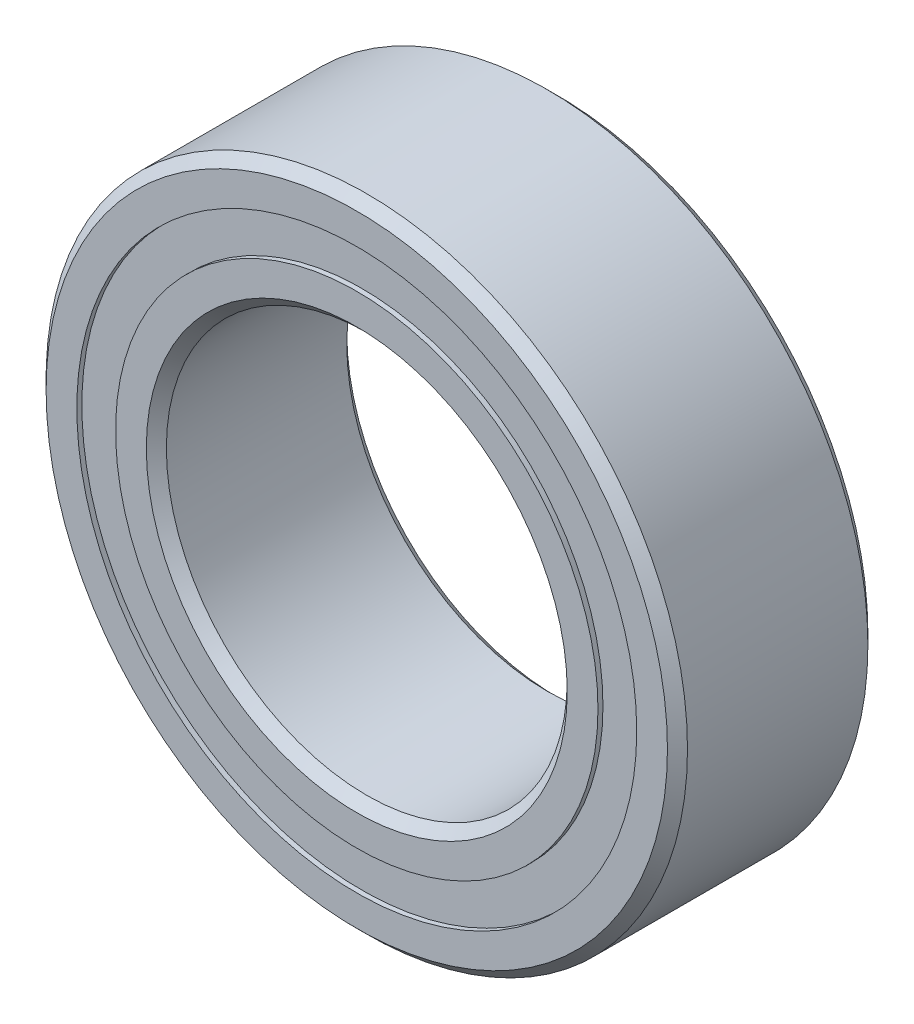
ISO-10303-21;
HEADER;
FILE_DESCRIPTION(('STEP AP214'),'2;1');
FILE_NAME('part.step','',(''),(''),'','','');
FILE_SCHEMA(('AUTOMOTIVE_DESIGN { 1 0 10303 214 1 1 1 1 }'));
ENDSEC;
DATA;
#1=APPLICATION_CONTEXT('core data for automotive mechanical design processes');
#2=APPLICATION_PROTOCOL_DEFINITION('international standard','automotive_design',2000,#1);
#3=PRODUCT_CONTEXT('',#1,'mechanical');
#4=PRODUCT('Part','Part','',(#3));
#5=PRODUCT_RELATED_PRODUCT_CATEGORY('part','',(#4));
#6=PRODUCT_DEFINITION_FORMATION('','',#4);
#7=PRODUCT_DEFINITION_CONTEXT('part definition',#1,'design');
#8=PRODUCT_DEFINITION('design','',#6,#7);
#9=PRODUCT_DEFINITION_SHAPE('','',#8);
#10=(LENGTH_UNIT() NAMED_UNIT(*) SI_UNIT(.MILLI.,.METRE.));
#11=(NAMED_UNIT(*) PLANE_ANGLE_UNIT() SI_UNIT($,.RADIAN.));
#12=(NAMED_UNIT(*) SI_UNIT($,.STERADIAN.) SOLID_ANGLE_UNIT());
#13=UNCERTAINTY_MEASURE_WITH_UNIT(LENGTH_MEASURE(1.E-05),#10,'distance_accuracy_value','');
#14=(GEOMETRIC_REPRESENTATION_CONTEXT(3) GLOBAL_UNCERTAINTY_ASSIGNED_CONTEXT((#13)) GLOBAL_UNIT_ASSIGNED_CONTEXT((#10,
#11,#12)) REPRESENTATION_CONTEXT('',''));
#15=CARTESIAN_POINT('',(0.,0.,0.));
#16=DIRECTION('',(0.,0.,1.));
#17=DIRECTION('',(1.,0.,0.));
#18=AXIS2_PLACEMENT_3D('',#15,#16,#17);
#19=CARTESIAN_POINT('',(0.,3.49175824175824,-1.1875));
#20=DIRECTION('',(0.,0.,1.));
#21=DIRECTION('',(1.,0.,0.));
#22=AXIS2_PLACEMENT_3D('',#19,#20,#21);
#23=PLANE('',#22);
#24=CARTESIAN_POINT('',(0.,0.,-1.1875));
#25=DIRECTION('',(0.,0.,1.));
#26=DIRECTION('',(1.,0.,0.));
#27=AXIS2_PLACEMENT_3D('',#24,#25,#26);
#28=CIRCLE('',#27,3.49175824175824);
#29=CARTESIAN_POINT('',(3.49175824175824,0.,-1.1875));
#30=VERTEX_POINT('',#29);
#31=EDGE_CURVE('E55',#30,#30,#28,.T.);
#32=ORIENTED_EDGE('',*,*,#31,.F.);
#33=EDGE_LOOP('',(#32));
#34=FACE_BOUND('',#33,.T.);
#35=CARTESIAN_POINT('',(0.,0.,-1.1875));
#36=DIRECTION('',(0.,0.,1.));
#37=DIRECTION('',(1.,0.,0.));
#38=AXIS2_PLACEMENT_3D('',#35,#36,#37);
#39=CIRCLE('',#38,3.00824175824176);
#40=CARTESIAN_POINT('',(3.00824175824176,0.,-1.1875));
#41=VERTEX_POINT('',#40);
#42=EDGE_CURVE('E11',#41,#41,#39,.T.);
#43=ORIENTED_EDGE('',*,*,#42,.T.);
#44=EDGE_LOOP('',(#43));
#45=FACE_BOUND('',#44,.T.);
#46=ADVANCED_FACE('F41',(#34,#45),#23,.F.);
#47=CARTESIAN_POINT('',(0.,0.,1.25));
#48=DIRECTION('',(0.,0.,1.));
#49=DIRECTION('',(1.,0.,0.));
#50=AXIS2_PLACEMENT_3D('',#47,#48,#49);
#51=CYLINDRICAL_SURFACE('',#50,3.00824175824176);
#52=ORIENTED_EDGE('',*,*,#42,.F.);
#53=EDGE_LOOP('',(#52));
#54=FACE_BOUND('',#53,.T.);
#55=CARTESIAN_POINT('',(0.,0.,-0.605878719519574));
#56=DIRECTION('',(0.,0.,1.));
#57=DIRECTION('',(1.,0.,0.));
#58=AXIS2_PLACEMENT_3D('',#55,#56,#57);
#59=CIRCLE('',#58,3.00824175824176);
#60=CARTESIAN_POINT('',(3.00824175824176,0.,-0.605878719519574));
#61=VERTEX_POINT('',#60);
#62=EDGE_CURVE('E47',#61,#61,#59,.T.);
#63=ORIENTED_EDGE('',*,*,#62,.T.);
#64=EDGE_LOOP('',(#63));
#65=FACE_BOUND('',#64,.T.);
#66=ADVANCED_FACE('F64',(#54,#65),#51,.F.);
#67=CARTESIAN_POINT('',(0.,3.49175824175824,-0.605878719519574));
#68=DIRECTION('',(0.,0.,-1.));
#69=DIRECTION('',(-1.,0.,0.));
#70=AXIS2_PLACEMENT_3D('',#67,#68,#69);
#71=PLANE('',#70);
#72=ORIENTED_EDGE('',*,*,#62,.F.);
#73=EDGE_LOOP('',(#72));
#74=FACE_BOUND('',#73,.T.);
#75=CARTESIAN_POINT('',(0.,0.,-0.605878719519574));
#76=DIRECTION('',(0.,0.,1.));
#77=DIRECTION('',(1.,0.,0.));
#78=AXIS2_PLACEMENT_3D('',#75,#76,#77);
#79=CIRCLE('',#78,3.49175824175824);
#80=CARTESIAN_POINT('',(3.49175824175824,0.,-0.605878719519574));
#81=VERTEX_POINT('',#80);
#82=EDGE_CURVE('E51',#81,#81,#79,.T.);
#83=ORIENTED_EDGE('',*,*,#82,.T.);
#84=EDGE_LOOP('',(#83));
#85=FACE_BOUND('',#84,.T.);
#86=ADVANCED_FACE('F68',(#74,#85),#71,.F.);
#87=CARTESIAN_POINT('',(0.,0.,1.25));
#88=DIRECTION('',(0.,0.,1.));
#89=DIRECTION('',(1.,0.,0.));
#90=AXIS2_PLACEMENT_3D('',#87,#88,#89);
#91=CYLINDRICAL_SURFACE('',#90,3.49175824175824);
#92=ORIENTED_EDGE('',*,*,#82,.F.);
#93=EDGE_LOOP('',(#92));
#94=FACE_BOUND('',#93,.T.);
#95=ORIENTED_EDGE('',*,*,#31,.T.);
#96=EDGE_LOOP('',(#95));
#97=FACE_BOUND('',#96,.T.);
#98=ADVANCED_FACE('F61',(#94,#97),#91,.T.);
#99=CLOSED_SHELL('',(#46,#66,#86,#98));
#100=MANIFOLD_SOLID_BREP('B2',#99);
#101=CARTESIAN_POINT('',(0.,3.49175824175824,1.1875));
#102=DIRECTION('',(0.,0.,-1.));
#103=DIRECTION('',(-1.,0.,0.));
#104=AXIS2_PLACEMENT_3D('',#101,#102,#103);
#105=PLANE('',#104);
#106=CARTESIAN_POINT('',(0.,0.,1.1875));
#107=DIRECTION('',(0.,0.,1.));
#108=DIRECTION('',(1.,0.,0.));
#109=AXIS2_PLACEMENT_3D('',#106,#107,#108);
#110=CIRCLE('',#109,3.00824175824176);
#111=CARTESIAN_POINT('',(3.00824175824176,0.,1.1875));
#112=VERTEX_POINT('',#111);
#113=EDGE_CURVE('E40',#112,#112,#110,.T.);
#114=ORIENTED_EDGE('',*,*,#113,.F.);
#115=EDGE_LOOP('',(#114));
#116=FACE_BOUND('',#115,.T.);
#117=CARTESIAN_POINT('',(0.,0.,1.1875));
#118=DIRECTION('',(0.,0.,1.));
#119=DIRECTION('',(1.,0.,0.));
#120=AXIS2_PLACEMENT_3D('',#117,#118,#119);
#121=CIRCLE('',#120,3.49175824175824);
#122=CARTESIAN_POINT('',(3.49175824175824,0.,1.1875));
#123=VERTEX_POINT('',#122);
#124=EDGE_CURVE('E122',#123,#123,#121,.T.);
#125=ORIENTED_EDGE('',*,*,#124,.T.);
#126=EDGE_LOOP('',(#125));
#127=FACE_BOUND('',#126,.T.);
#128=ADVANCED_FACE('F108',(#116,#127),#105,.F.);
#129=CARTESIAN_POINT('',(0.,0.,1.25));
#130=DIRECTION('',(0.,0.,1.));
#131=DIRECTION('',(1.,0.,0.));
#132=AXIS2_PLACEMENT_3D('',#129,#130,#131);
#133=CYLINDRICAL_SURFACE('',#132,3.00824175824176);
#134=CARTESIAN_POINT('',(0.,0.,0.605878719519573));
#135=DIRECTION('',(0.,0.,1.));
#136=DIRECTION('',(1.,0.,0.));
#137=AXIS2_PLACEMENT_3D('',#134,#135,#136);
#138=CIRCLE('',#137,3.00824175824176);
#139=CARTESIAN_POINT('',(3.00824175824176,0.,0.605878719519573));
#140=VERTEX_POINT('',#139);
#141=EDGE_CURVE('E114',#140,#140,#138,.T.);
#142=ORIENTED_EDGE('',*,*,#141,.F.);
#143=EDGE_LOOP('',(#142));
#144=FACE_BOUND('',#143,.T.);
#145=ORIENTED_EDGE('',*,*,#113,.T.);
#146=EDGE_LOOP('',(#145));
#147=FACE_BOUND('',#146,.T.);
#148=ADVANCED_FACE('F137',(#144,#147),#133,.F.);
#149=CARTESIAN_POINT('',(0.,3.49175824175824,0.605878719519573));
#150=DIRECTION('',(0.,0.,1.));
#151=DIRECTION('',(1.,0.,0.));
#152=AXIS2_PLACEMENT_3D('',#149,#150,#151);
#153=PLANE('',#152);
#154=CARTESIAN_POINT('',(0.,0.,0.605878719519573));
#155=DIRECTION('',(0.,0.,1.));
#156=DIRECTION('',(1.,0.,0.));
#157=AXIS2_PLACEMENT_3D('',#154,#155,#156);
#158=CIRCLE('',#157,3.49175824175824);
#159=CARTESIAN_POINT('',(3.49175824175824,0.,0.605878719519573));
#160=VERTEX_POINT('',#159);
#161=EDGE_CURVE('E118',#160,#160,#158,.T.);
#162=ORIENTED_EDGE('',*,*,#161,.F.);
#163=EDGE_LOOP('',(#162));
#164=FACE_BOUND('',#163,.T.);
#165=ORIENTED_EDGE('',*,*,#141,.T.);
#166=EDGE_LOOP('',(#165));
#167=FACE_BOUND('',#166,.T.);
#168=ADVANCED_FACE('F132',(#164,#167),#153,.F.);
#169=CARTESIAN_POINT('',(0.,0.,1.25));
#170=DIRECTION('',(0.,0.,1.));
#171=DIRECTION('',(1.,0.,0.));
#172=AXIS2_PLACEMENT_3D('',#169,#170,#171);
#173=CYLINDRICAL_SURFACE('',#172,3.49175824175824);
#174=ORIENTED_EDGE('',*,*,#124,.F.);
#175=EDGE_LOOP('',(#174));
#176=FACE_BOUND('',#175,.T.);
#177=ORIENTED_EDGE('',*,*,#161,.T.);
#178=EDGE_LOOP('',(#177));
#179=FACE_BOUND('',#178,.T.);
#180=ADVANCED_FACE('F129',(#176,#179),#173,.T.);
#181=CLOSED_SHELL('',(#128,#148,#168,#180));
#182=MANIFOLD_SOLID_BREP('B6',#181);
#183=CARTESIAN_POINT('',(-1.62499999999996,2.81458256229945,0.));
#184=DIRECTION('',(0.,0.,1.));
#185=DIRECTION('',(-0.499999999999989,0.866025403784445,0.));
#186=AXIS2_PLACEMENT_3D('',#183,#184,#185);
#187=SPHERICAL_SURFACE('',#186,0.605878719519574);
#188=CARTESIAN_POINT('',(-1.62499999999996,2.81458256229945,0.605878719519573));
#189=VERTEX_POINT('',#188);
#190=VERTEX_LOOP('',#189);
#191=FACE_BOUND('',#190,.T.);
#192=ADVANCED_FACE('F175',(#191),#187,.T.);
#193=CLOSED_SHELL('',(#192));
#194=MANIFOLD_SOLID_BREP('B35',#193);
#195=CARTESIAN_POINT('',(-2.81458256229941,1.62500000000003,0.));
#196=DIRECTION('',(0.,0.,1.));
#197=DIRECTION('',(-0.866025403784433,0.50000000000001,0.));
#198=AXIS2_PLACEMENT_3D('',#195,#196,#197);
#199=SPHERICAL_SURFACE('',#198,0.605878719519574);
#200=CARTESIAN_POINT('',(-2.81458256229941,1.62500000000003,0.605878719519573));
#201=VERTEX_POINT('',#200);
#202=VERTEX_LOOP('',#201);
#203=FACE_BOUND('',#202,.T.);
#204=ADVANCED_FACE('F195',(#203),#199,.T.);
#205=CLOSED_SHELL('',(#204));
#206=MANIFOLD_SOLID_BREP('B104',#205);
#207=CARTESIAN_POINT('',(-3.25,0.,0.));
#208=DIRECTION('',(0.,0.,1.));
#209=DIRECTION('',(-1.,0.,0.));
#210=AXIS2_PLACEMENT_3D('',#207,#208,#209);
#211=SPHERICAL_SURFACE('',#210,0.605878719519574);
#212=CARTESIAN_POINT('',(-3.25,0.,0.605878719519573));
#213=VERTEX_POINT('',#212);
#214=VERTEX_LOOP('',#213);
#215=FACE_BOUND('',#214,.T.);
#216=ADVANCED_FACE('F215',(#215),#211,.T.);
#217=CLOSED_SHELL('',(#216));
#218=MANIFOLD_SOLID_BREP('B171',#217);
#219=CARTESIAN_POINT('',(-2.81458256229944,-1.62499999999997,0.));
#220=DIRECTION('',(0.,0.,1.));
#221=DIRECTION('',(-0.866025403784443,-0.499999999999992,0.));
#222=AXIS2_PLACEMENT_3D('',#219,#220,#221);
#223=SPHERICAL_SURFACE('',#222,0.605878719519574);
#224=CARTESIAN_POINT('',(-2.81458256229944,-1.62499999999997,0.605878719519573));
#225=VERTEX_POINT('',#224);
#226=VERTEX_LOOP('',#225);
#227=FACE_BOUND('',#226,.T.);
#228=ADVANCED_FACE('F235',(#227),#223,.T.);
#229=CLOSED_SHELL('',(#228));
#230=MANIFOLD_SOLID_BREP('B191',#229);
#231=CARTESIAN_POINT('',(-1.62500000000002,-2.81458256229941,0.));
#232=DIRECTION('',(0.,0.,1.));
#233=DIRECTION('',(-0.500000000000007,-0.866025403784435,0.));
#234=AXIS2_PLACEMENT_3D('',#231,#232,#233);
#235=SPHERICAL_SURFACE('',#234,0.605878719519574);
#236=CARTESIAN_POINT('',(-1.62500000000002,-2.81458256229941,0.605878719519573));
#237=VERTEX_POINT('',#236);
#238=VERTEX_LOOP('',#237);
#239=FACE_BOUND('',#238,.T.);
#240=ADVANCED_FACE('F255',(#239),#235,.T.);
#241=CLOSED_SHELL('',(#240));
#242=MANIFOLD_SOLID_BREP('B211',#241);
#243=CARTESIAN_POINT('',(0.,-3.25,0.));
#244=DIRECTION('',(0.,0.,1.));
#245=DIRECTION('',(0.,-1.,0.));
#246=AXIS2_PLACEMENT_3D('',#243,#244,#245);
#247=SPHERICAL_SURFACE('',#246,0.605878719519574);
#248=CARTESIAN_POINT('',(0.,-3.25,0.605878719519573));
#249=VERTEX_POINT('',#248);
#250=VERTEX_LOOP('',#249);
#251=FACE_BOUND('',#250,.T.);
#252=ADVANCED_FACE('F275',(#251),#247,.T.);
#253=CLOSED_SHELL('',(#252));
#254=MANIFOLD_SOLID_BREP('B231',#253);
#255=CARTESIAN_POINT('',(1.62499999999998,-2.81458256229944,0.));
#256=DIRECTION('',(0.,0.,1.));
#257=DIRECTION('',(0.499999999999995,-0.866025403784442,0.));
#258=AXIS2_PLACEMENT_3D('',#255,#256,#257);
#259=SPHERICAL_SURFACE('',#258,0.605878719519574);
#260=CARTESIAN_POINT('',(1.62499999999998,-2.81458256229944,0.605878719519573));
#261=VERTEX_POINT('',#260);
#262=VERTEX_LOOP('',#261);
#263=FACE_BOUND('',#262,.T.);
#264=ADVANCED_FACE('F295',(#263),#259,.T.);
#265=CLOSED_SHELL('',(#264));
#266=MANIFOLD_SOLID_BREP('B251',#265);
#267=CARTESIAN_POINT('',(2.81458256229942,-1.62500000000001,0.));
#268=DIRECTION('',(0.,0.,1.));
#269=DIRECTION('',(0.866025403784436,-0.500000000000004,0.));
#270=AXIS2_PLACEMENT_3D('',#267,#268,#269);
#271=SPHERICAL_SURFACE('',#270,0.605878719519574);
#272=CARTESIAN_POINT('',(2.81458256229942,-1.62500000000001,0.605878719519573));
#273=VERTEX_POINT('',#272);
#274=VERTEX_LOOP('',#273);
#275=FACE_BOUND('',#274,.T.);
#276=ADVANCED_FACE('F315',(#275),#271,.T.);
#277=CLOSED_SHELL('',(#276));
#278=MANIFOLD_SOLID_BREP('B271',#277);
#279=CARTESIAN_POINT('',(3.25,0.,0.));
#280=DIRECTION('',(0.,0.,1.));
#281=DIRECTION('',(1.,0.,0.));
#282=AXIS2_PLACEMENT_3D('',#279,#280,#281);
#283=SPHERICAL_SURFACE('',#282,0.605878719519574);
#284=CARTESIAN_POINT('',(3.25,0.,0.605878719519573));
#285=VERTEX_POINT('',#284);
#286=VERTEX_LOOP('',#285);
#287=FACE_BOUND('',#286,.T.);
#288=ADVANCED_FACE('F335',(#287),#283,.T.);
#289=CLOSED_SHELL('',(#288));
#290=MANIFOLD_SOLID_BREP('B291',#289);
#291=CARTESIAN_POINT('',(2.81458256229943,1.62499999999999,0.));
#292=DIRECTION('',(0.,0.,1.));
#293=DIRECTION('',(0.86602540378444,0.499999999999998,0.));
#294=AXIS2_PLACEMENT_3D('',#291,#292,#293);
#295=SPHERICAL_SURFACE('',#294,0.605878719519574);
#296=CARTESIAN_POINT('',(2.81458256229943,1.62499999999999,0.605878719519573));
#297=VERTEX_POINT('',#296);
#298=VERTEX_LOOP('',#297);
#299=FACE_BOUND('',#298,.T.);
#300=ADVANCED_FACE('F355',(#299),#295,.T.);
#301=CLOSED_SHELL('',(#300));
#302=MANIFOLD_SOLID_BREP('B311',#301);
#303=CARTESIAN_POINT('',(1.625,2.81458256229942,0.));
#304=DIRECTION('',(0.,0.,1.));
#305=DIRECTION('',(0.500000000000001,0.866025403784438,0.));
#306=AXIS2_PLACEMENT_3D('',#303,#304,#305);
#307=SPHERICAL_SURFACE('',#306,0.605878719519574);
#308=CARTESIAN_POINT('',(1.625,2.81458256229942,0.605878719519573));
#309=VERTEX_POINT('',#308);
#310=VERTEX_LOOP('',#309);
#311=FACE_BOUND('',#310,.T.);
#312=ADVANCED_FACE('F375',(#311),#307,.T.);
#313=CLOSED_SHELL('',(#312));
#314=MANIFOLD_SOLID_BREP('B331',#313);
#315=CARTESIAN_POINT('',(0.,3.25,0.));
#316=DIRECTION('',(0.,0.,1.));
#317=DIRECTION('',(0.,1.,0.));
#318=AXIS2_PLACEMENT_3D('',#315,#316,#317);
#319=SPHERICAL_SURFACE('',#318,0.605878719519574);
#320=CARTESIAN_POINT('',(0.,3.25,0.605878719519573));
#321=VERTEX_POINT('',#320);
#322=VERTEX_LOOP('',#321);
#323=FACE_BOUND('',#322,.T.);
#324=ADVANCED_FACE('F397',(#323),#319,.T.);
#325=CLOSED_SHELL('',(#324));
#326=MANIFOLD_SOLID_BREP('B351',#325);
#327=CARTESIAN_POINT('',(0.,3.00824175824176,1.25));
#328=DIRECTION('',(0.,0.,-1.));
#329=DIRECTION('',(-1.,0.,0.));
#330=AXIS2_PLACEMENT_3D('',#327,#328,#329);
#331=PLANE('',#330);
#332=CARTESIAN_POINT('',(0.,0.,1.25));
#333=DIRECTION('',(0.,0.,1.));
#334=DIRECTION('',(1.,0.,0.));
#335=AXIS2_PLACEMENT_3D('',#332,#333,#334);
#336=CIRCLE('',#335,2.625);
#337=CARTESIAN_POINT('',(2.625,0.,1.25));
#338=VERTEX_POINT('',#337);
#339=EDGE_CURVE('E444',#338,#338,#336,.T.);
#340=ORIENTED_EDGE('',*,*,#339,.F.);
#341=EDGE_LOOP('',(#340));
#342=FACE_BOUND('',#341,.T.);
#343=CARTESIAN_POINT('',(0.,0.,1.25));
#344=DIRECTION('',(0.,0.,1.));
#345=DIRECTION('',(1.,0.,0.));
#346=AXIS2_PLACEMENT_3D('',#343,#344,#345);
#347=CIRCLE('',#346,3.00824175824176);
#348=CARTESIAN_POINT('',(3.00824175824176,0.,1.25));
#349=VERTEX_POINT('',#348);
#350=EDGE_CURVE('E396',#349,#349,#347,.T.);
#351=ORIENTED_EDGE('',*,*,#350,.T.);
#352=EDGE_LOOP('',(#351));
#353=FACE_BOUND('',#352,.T.);
#354=ADVANCED_FACE('F416',(#342,#353),#331,.F.);
#355=CARTESIAN_POINT('',(0.,0.,1.25));
#356=DIRECTION('',(0.,0.,1.));
#357=DIRECTION('',(1.,0.,0.));
#358=AXIS2_PLACEMENT_3D('',#355,#356,#357);
#359=CYLINDRICAL_SURFACE('',#358,3.00824175824176);
#360=ORIENTED_EDGE('',*,*,#350,.F.);
#361=EDGE_LOOP('',(#360));
#362=FACE_BOUND('',#361,.T.);
#363=CARTESIAN_POINT('',(0.,0.,0.555555555555555));
#364=DIRECTION('',(0.,0.,1.));
#365=DIRECTION('',(1.,0.,0.));
#366=AXIS2_PLACEMENT_3D('',#363,#364,#365);
#367=CIRCLE('',#366,3.00824175824176);
#368=CARTESIAN_POINT('',(3.00824175824176,0.,0.555555555555555));
#369=VERTEX_POINT('',#368);
#370=EDGE_CURVE('E422',#369,#369,#367,.T.);
#371=ORIENTED_EDGE('',*,*,#370,.T.);
#372=EDGE_LOOP('',(#371));
#373=FACE_BOUND('',#372,.T.);
#374=ADVANCED_FACE('F451',(#362,#373),#359,.T.);
#375=CARTESIAN_POINT('',(0.,0.,0.));
#376=DIRECTION('',(0.,0.,1.));
#377=DIRECTION('',(1.,0.,0.));
#378=AXIS2_PLACEMENT_3D('',#375,#376,#377);
#379=TOROIDAL_SURFACE('',#378,3.25,0.605878719519572);
#380=ORIENTED_EDGE('',*,*,#370,.F.);
#381=EDGE_LOOP('',(#380));
#382=FACE_BOUND('',#381,.T.);
#383=CARTESIAN_POINT('',(0.,0.,-0.555555555555556));
#384=DIRECTION('',(0.,0.,1.));
#385=DIRECTION('',(1.,0.,0.));
#386=AXIS2_PLACEMENT_3D('',#383,#384,#385);
#387=CIRCLE('',#386,3.00824175824176);
#388=CARTESIAN_POINT('',(3.00824175824176,0.,-0.555555555555556));
#389=VERTEX_POINT('',#388);
#390=EDGE_CURVE('E426',#389,#389,#387,.T.);
#391=ORIENTED_EDGE('',*,*,#390,.T.);
#392=EDGE_LOOP('',(#391));
#393=FACE_BOUND('',#392,.T.);
#394=ADVANCED_FACE('F455',(#382,#393),#379,.F.);
#395=CARTESIAN_POINT('',(0.,0.,1.25));
#396=DIRECTION('',(0.,0.,1.));
#397=DIRECTION('',(1.,0.,0.));
#398=AXIS2_PLACEMENT_3D('',#395,#396,#397);
#399=CYLINDRICAL_SURFACE('',#398,3.00824175824176);
#400=ORIENTED_EDGE('',*,*,#390,.F.);
#401=EDGE_LOOP('',(#400));
#402=FACE_BOUND('',#401,.T.);
#403=CARTESIAN_POINT('',(0.,0.,-1.25));
#404=DIRECTION('',(0.,0.,1.));
#405=DIRECTION('',(1.,0.,0.));
#406=AXIS2_PLACEMENT_3D('',#403,#404,#405);
#407=CIRCLE('',#406,3.00824175824176);
#408=CARTESIAN_POINT('',(3.00824175824176,0.,-1.25));
#409=VERTEX_POINT('',#408);
#410=EDGE_CURVE('E430',#409,#409,#407,.T.);
#411=ORIENTED_EDGE('',*,*,#410,.T.);
#412=EDGE_LOOP('',(#411));
#413=FACE_BOUND('',#412,.T.);
#414=ADVANCED_FACE('F460',(#402,#413),#399,.T.);
#415=CARTESIAN_POINT('',(0.,2.625,-1.25));
#416=DIRECTION('',(0.,0.,1.));
#417=DIRECTION('',(1.,0.,0.));
#418=AXIS2_PLACEMENT_3D('',#415,#416,#417);
#419=PLANE('',#418);
#420=ORIENTED_EDGE('',*,*,#410,.F.);
#421=EDGE_LOOP('',(#420));
#422=FACE_BOUND('',#421,.T.);
#423=CARTESIAN_POINT('',(0.,0.,-1.25));
#424=DIRECTION('',(0.,0.,1.));
#425=DIRECTION('',(1.,0.,0.));
#426=AXIS2_PLACEMENT_3D('',#423,#424,#425);
#427=CIRCLE('',#426,2.625);
#428=CARTESIAN_POINT('',(2.625,0.,-1.25));
#429=VERTEX_POINT('',#428);
#430=EDGE_CURVE('E435',#429,#429,#427,.T.);
#431=ORIENTED_EDGE('',*,*,#430,.T.);
#432=EDGE_LOOP('',(#431));
#433=FACE_BOUND('',#432,.T.);
#434=ADVANCED_FACE('F466',(#422,#433),#419,.F.);
#435=CARTESIAN_POINT('',(0.,0.,-1.125));
#436=DIRECTION('',(0.,0.,-1.));
#437=DIRECTION('',(-1.,0.,0.));
#438=AXIS2_PLACEMENT_3D('',#435,#436,#437);
#439=CONICAL_SURFACE('',#438,2.5,0.785398163397443);
#440=ORIENTED_EDGE('',*,*,#430,.F.);
#441=EDGE_LOOP('',(#440));
#442=FACE_BOUND('',#441,.T.);
#443=CARTESIAN_POINT('',(0.,0.,-1.125));
#444=DIRECTION('',(0.,0.,1.));
#445=DIRECTION('',(1.,0.,0.));
#446=AXIS2_PLACEMENT_3D('',#443,#444,#445);
#447=CIRCLE('',#446,2.5);
#448=CARTESIAN_POINT('',(2.5,0.,-1.125));
#449=VERTEX_POINT('',#448);
#450=EDGE_CURVE('E438',#449,#449,#447,.T.);
#451=ORIENTED_EDGE('',*,*,#450,.T.);
#452=EDGE_LOOP('',(#451));
#453=FACE_BOUND('',#452,.T.);
#454=ADVANCED_FACE('F470',(#442,#453),#439,.F.);
#455=CARTESIAN_POINT('',(0.,0.,1.25));
#456=DIRECTION('',(0.,0.,1.));
#457=DIRECTION('',(1.,0.,0.));
#458=AXIS2_PLACEMENT_3D('',#455,#456,#457);
#459=CYLINDRICAL_SURFACE('',#458,2.5);
#460=ORIENTED_EDGE('',*,*,#450,.F.);
#461=EDGE_LOOP('',(#460));
#462=FACE_BOUND('',#461,.T.);
#463=CARTESIAN_POINT('',(0.,0.,1.125));
#464=DIRECTION('',(0.,0.,1.));
#465=DIRECTION('',(1.,0.,0.));
#466=AXIS2_PLACEMENT_3D('',#463,#464,#465);
#467=CIRCLE('',#466,2.5);
#468=CARTESIAN_POINT('',(2.5,0.,1.125));
#469=VERTEX_POINT('',#468);
#470=EDGE_CURVE('E441',#469,#469,#467,.T.);
#471=ORIENTED_EDGE('',*,*,#470,.T.);
#472=EDGE_LOOP('',(#471));
#473=FACE_BOUND('',#472,.T.);
#474=ADVANCED_FACE('F474',(#462,#473),#459,.F.);
#475=CARTESIAN_POINT('',(0.,0.,1.25));
#476=DIRECTION('',(0.,0.,1.));
#477=DIRECTION('',(1.,0.,0.));
#478=AXIS2_PLACEMENT_3D('',#475,#476,#477);
#479=CONICAL_SURFACE('',#478,2.625,0.785398163397454);
#480=ORIENTED_EDGE('',*,*,#470,.F.);
#481=EDGE_LOOP('',(#480));
#482=FACE_BOUND('',#481,.T.);
#483=ORIENTED_EDGE('',*,*,#339,.T.);
#484=EDGE_LOOP('',(#483));
#485=FACE_BOUND('',#484,.T.);
#486=ADVANCED_FACE('F448',(#482,#485),#479,.F.);
#487=CLOSED_SHELL('',(#354,#374,#394,#414,#434,#454,#474,#486));
#488=MANIFOLD_SOLID_BREP('B371',#487);
#489=CARTESIAN_POINT('',(0.,0.,1.125));
#490=DIRECTION('',(0.,0.,-1.));
#491=DIRECTION('',(-1.,0.,0.));
#492=AXIS2_PLACEMENT_3D('',#489,#490,#491);
#493=CONICAL_SURFACE('',#492,4.,0.785398163397446);
#494=CARTESIAN_POINT('',(0.,0.,1.25));
#495=DIRECTION('',(0.,0.,1.));
#496=DIRECTION('',(1.,0.,0.));
#497=AXIS2_PLACEMENT_3D('',#494,#495,#496);
#498=CIRCLE('',#497,3.875);
#499=CARTESIAN_POINT('',(3.875,0.,1.25));
#500=VERTEX_POINT('',#499);
#501=EDGE_CURVE('E565',#500,#500,#498,.T.);
#502=ORIENTED_EDGE('',*,*,#501,.F.);
#503=EDGE_LOOP('',(#502));
#504=FACE_BOUND('',#503,.T.);
#505=CARTESIAN_POINT('',(0.,0.,1.125));
#506=DIRECTION('',(0.,0.,1.));
#507=DIRECTION('',(1.,0.,0.));
#508=AXIS2_PLACEMENT_3D('',#505,#506,#507);
#509=CIRCLE('',#508,4.);
#510=CARTESIAN_POINT('',(4.,0.,1.125));
#511=VERTEX_POINT('',#510);
#512=EDGE_CURVE('E415',#511,#511,#509,.T.);
#513=ORIENTED_EDGE('',*,*,#512,.T.);
#514=EDGE_LOOP('',(#513));
#515=FACE_BOUND('',#514,.T.);
#516=ADVANCED_FACE('F537',(#504,#515),#493,.T.);
#517=CARTESIAN_POINT('',(0.,0.,1.25));
#518=DIRECTION('',(0.,0.,1.));
#519=DIRECTION('',(1.,0.,0.));
#520=AXIS2_PLACEMENT_3D('',#517,#518,#519);
#521=CYLINDRICAL_SURFACE('',#520,4.);
#522=ORIENTED_EDGE('',*,*,#512,.F.);
#523=EDGE_LOOP('',(#522));
#524=FACE_BOUND('',#523,.T.);
#525=CARTESIAN_POINT('',(0.,0.,-1.125));
#526=DIRECTION('',(0.,0.,1.));
#527=DIRECTION('',(1.,0.,0.));
#528=AXIS2_PLACEMENT_3D('',#525,#526,#527);
#529=CIRCLE('',#528,4.);
#530=CARTESIAN_POINT('',(4.,0.,-1.125));
#531=VERTEX_POINT('',#530);
#532=EDGE_CURVE('E543',#531,#531,#529,.T.);
#533=ORIENTED_EDGE('',*,*,#532,.T.);
#534=EDGE_LOOP('',(#533));
#535=FACE_BOUND('',#534,.T.);
#536=ADVANCED_FACE('F572',(#524,#535),#521,.T.);
#537=CARTESIAN_POINT('',(0.,0.,-1.25));
#538=DIRECTION('',(0.,0.,1.));
#539=DIRECTION('',(1.,0.,0.));
#540=AXIS2_PLACEMENT_3D('',#537,#538,#539);
#541=CONICAL_SURFACE('',#540,3.875,0.785398163397443);
#542=ORIENTED_EDGE('',*,*,#532,.F.);
#543=EDGE_LOOP('',(#542));
#544=FACE_BOUND('',#543,.T.);
#545=CARTESIAN_POINT('',(0.,0.,-1.25));
#546=DIRECTION('',(0.,0.,1.));
#547=DIRECTION('',(1.,0.,0.));
#548=AXIS2_PLACEMENT_3D('',#545,#546,#547);
#549=CIRCLE('',#548,3.875);
#550=CARTESIAN_POINT('',(3.875,0.,-1.25));
#551=VERTEX_POINT('',#550);
#552=EDGE_CURVE('E547',#551,#551,#549,.T.);
#553=ORIENTED_EDGE('',*,*,#552,.T.);
#554=EDGE_LOOP('',(#553));
#555=FACE_BOUND('',#554,.T.);
#556=ADVANCED_FACE('F576',(#544,#555),#541,.T.);
#557=CARTESIAN_POINT('',(0.,3.875,-1.25));
#558=DIRECTION('',(0.,0.,1.));
#559=DIRECTION('',(1.,0.,0.));
#560=AXIS2_PLACEMENT_3D('',#557,#558,#559);
#561=PLANE('',#560);
#562=ORIENTED_EDGE('',*,*,#552,.F.);
#563=EDGE_LOOP('',(#562));
#564=FACE_BOUND('',#563,.T.);
#565=CARTESIAN_POINT('',(0.,0.,-1.25));
#566=DIRECTION('',(0.,0.,1.));
#567=DIRECTION('',(1.,0.,0.));
#568=AXIS2_PLACEMENT_3D('',#565,#566,#567);
#569=CIRCLE('',#568,3.49175824175824);
#570=CARTESIAN_POINT('',(3.49175824175824,0.,-1.25));
#571=VERTEX_POINT('',#570);
#572=EDGE_CURVE('E551',#571,#571,#569,.T.);
#573=ORIENTED_EDGE('',*,*,#572,.T.);
#574=EDGE_LOOP('',(#573));
#575=FACE_BOUND('',#574,.T.);
#576=ADVANCED_FACE('F581',(#564,#575),#561,.F.);
#577=CARTESIAN_POINT('',(0.,0.,1.25));
#578=DIRECTION('',(0.,0.,1.));
#579=DIRECTION('',(1.,0.,0.));
#580=AXIS2_PLACEMENT_3D('',#577,#578,#579);
#581=CYLINDRICAL_SURFACE('',#580,3.49175824175824);
#582=ORIENTED_EDGE('',*,*,#572,.F.);
#583=EDGE_LOOP('',(#582));
#584=FACE_BOUND('',#583,.T.);
#585=CARTESIAN_POINT('',(0.,0.,-0.555555555555556));
#586=DIRECTION('',(0.,0.,1.));
#587=DIRECTION('',(1.,0.,0.));
#588=AXIS2_PLACEMENT_3D('',#585,#586,#587);
#589=CIRCLE('',#588,3.49175824175824);
#590=CARTESIAN_POINT('',(3.49175824175824,0.,-0.555555555555556));
#591=VERTEX_POINT('',#590);
#592=EDGE_CURVE('E556',#591,#591,#589,.T.);
#593=ORIENTED_EDGE('',*,*,#592,.T.);
#594=EDGE_LOOP('',(#593));
#595=FACE_BOUND('',#594,.T.);
#596=ADVANCED_FACE('F587',(#584,#595),#581,.F.);
#597=CARTESIAN_POINT('',(0.,0.,0.));
#598=DIRECTION('',(0.,0.,1.));
#599=DIRECTION('',(1.,0.,0.));
#600=AXIS2_PLACEMENT_3D('',#597,#598,#599);
#601=TOROIDAL_SURFACE('',#600,3.25,0.605878719519574);
#602=ORIENTED_EDGE('',*,*,#592,.F.);
#603=EDGE_LOOP('',(#602));
#604=FACE_BOUND('',#603,.T.);
#605=CARTESIAN_POINT('',(0.,0.,0.555555555555555));
#606=DIRECTION('',(0.,0.,1.));
#607=DIRECTION('',(1.,0.,0.));
#608=AXIS2_PLACEMENT_3D('',#605,#606,#607);
#609=CIRCLE('',#608,3.49175824175824);
#610=CARTESIAN_POINT('',(3.49175824175824,0.,0.555555555555555));
#611=VERTEX_POINT('',#610);
#612=EDGE_CURVE('E559',#611,#611,#609,.T.);
#613=ORIENTED_EDGE('',*,*,#612,.T.);
#614=EDGE_LOOP('',(#613));
#615=FACE_BOUND('',#614,.T.);
#616=ADVANCED_FACE('F591',(#604,#615),#601,.F.);
#617=CARTESIAN_POINT('',(0.,0.,1.25));
#618=DIRECTION('',(0.,0.,1.));
#619=DIRECTION('',(1.,0.,0.));
#620=AXIS2_PLACEMENT_3D('',#617,#618,#619);
#621=CYLINDRICAL_SURFACE('',#620,3.49175824175824);
#622=ORIENTED_EDGE('',*,*,#612,.F.);
#623=EDGE_LOOP('',(#622));
#624=FACE_BOUND('',#623,.T.);
#625=CARTESIAN_POINT('',(0.,0.,1.25));
#626=DIRECTION('',(0.,0.,1.));
#627=DIRECTION('',(1.,0.,0.));
#628=AXIS2_PLACEMENT_3D('',#625,#626,#627);
#629=CIRCLE('',#628,3.49175824175824);
#630=CARTESIAN_POINT('',(3.49175824175824,0.,1.25));
#631=VERTEX_POINT('',#630);
#632=EDGE_CURVE('E562',#631,#631,#629,.T.);
#633=ORIENTED_EDGE('',*,*,#632,.T.);
#634=EDGE_LOOP('',(#633));
#635=FACE_BOUND('',#634,.T.);
#636=ADVANCED_FACE('F595',(#624,#635),#621,.F.);
#637=CARTESIAN_POINT('',(0.,3.875,1.25));
#638=DIRECTION('',(0.,0.,-1.));
#639=DIRECTION('',(-1.,0.,0.));
#640=AXIS2_PLACEMENT_3D('',#637,#638,#639);
#641=PLANE('',#640);
#642=ORIENTED_EDGE('',*,*,#632,.F.);
#643=EDGE_LOOP('',(#642));
#644=FACE_BOUND('',#643,.T.);
#645=ORIENTED_EDGE('',*,*,#501,.T.);
#646=EDGE_LOOP('',(#645));
#647=FACE_BOUND('',#646,.T.);
#648=ADVANCED_FACE('F569',(#644,#647),#641,.F.);
#649=CLOSED_SHELL('',(#516,#536,#556,#576,#596,#616,#636,#648));
#650=MANIFOLD_SOLID_BREP('B391',#649);
#651=ADVANCED_BREP_SHAPE_REPRESENTATION('',(#18,#100,#182,#194,#206,#218,#230,#242,#254,#266,
#278,#290,#302,#314,#326,#488,#650),#14);
#652=SHAPE_DEFINITION_REPRESENTATION(#9,#651);
ENDSEC;
END-ISO-10303-21;
